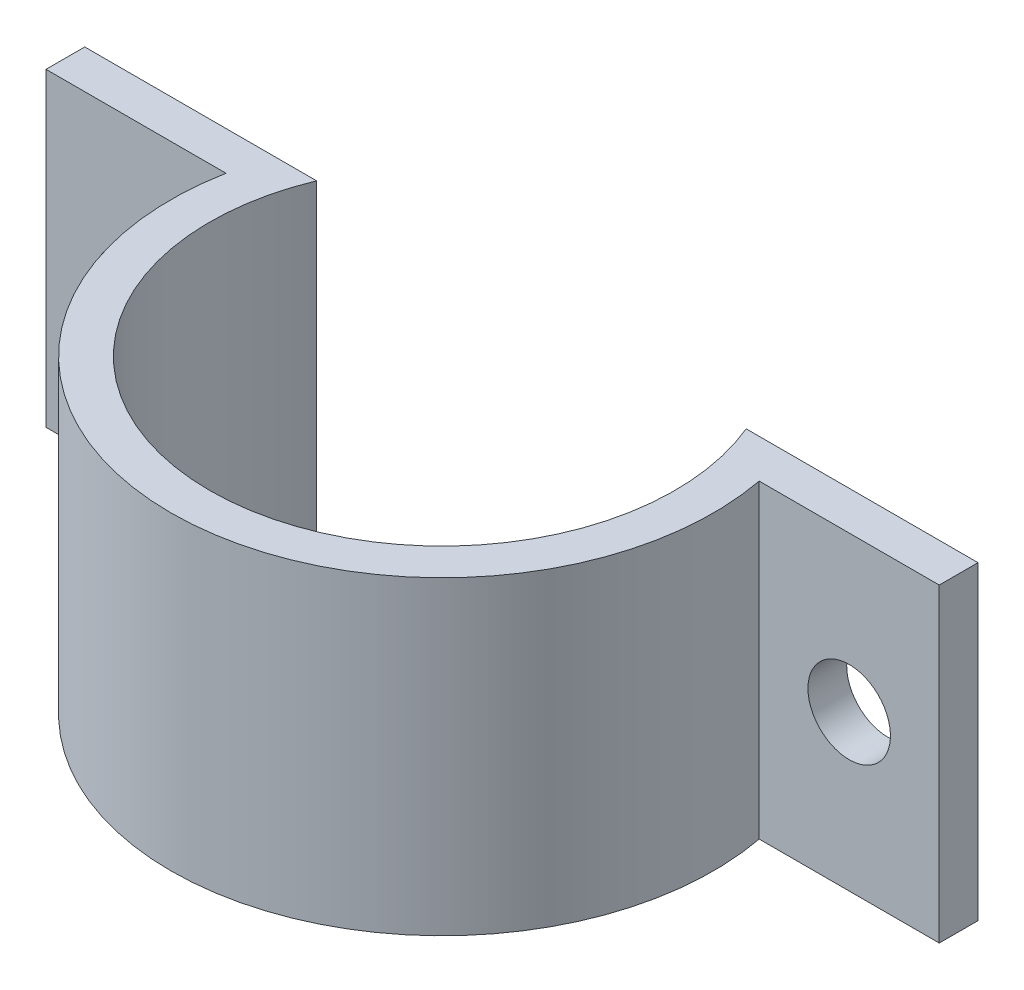
ISO-10303-21;
HEADER;
FILE_DESCRIPTION(('STEP AP214'),'2;1');
FILE_NAME('part.step','',(''),(''),'','','');
FILE_SCHEMA(('AUTOMOTIVE_DESIGN { 1 0 10303 214 1 1 1 1 }'));
ENDSEC;
DATA;
#1=APPLICATION_CONTEXT('core data for automotive mechanical design processes');
#2=APPLICATION_PROTOCOL_DEFINITION('international standard','automotive_design',2000,#1);
#3=PRODUCT_CONTEXT('',#1,'mechanical');
#4=PRODUCT('Part','Part','',(#3));
#5=PRODUCT_RELATED_PRODUCT_CATEGORY('part','',(#4));
#6=PRODUCT_DEFINITION_FORMATION('','',#4);
#7=PRODUCT_DEFINITION_CONTEXT('part definition',#1,'design');
#8=PRODUCT_DEFINITION('design','',#6,#7);
#9=PRODUCT_DEFINITION_SHAPE('','',#8);
#10=(LENGTH_UNIT() NAMED_UNIT(*) SI_UNIT(.MILLI.,.METRE.));
#11=(NAMED_UNIT(*) PLANE_ANGLE_UNIT() SI_UNIT($,.RADIAN.));
#12=(NAMED_UNIT(*) SI_UNIT($,.STERADIAN.) SOLID_ANGLE_UNIT());
#13=UNCERTAINTY_MEASURE_WITH_UNIT(LENGTH_MEASURE(1.E-05),#10,'distance_accuracy_value','');
#14=(GEOMETRIC_REPRESENTATION_CONTEXT(3) GLOBAL_UNCERTAINTY_ASSIGNED_CONTEXT((#13)) GLOBAL_UNIT_ASSIGNED_CONTEXT((#10,
#11,#12)) REPRESENTATION_CONTEXT('',''));
#15=CARTESIAN_POINT('',(0.,0.,0.));
#16=DIRECTION('',(0.,0.,1.));
#17=DIRECTION('',(1.,0.,0.));
#18=AXIS2_PLACEMENT_3D('',#15,#16,#17);
#19=CARTESIAN_POINT('',(0.,25.4,0.));
#20=DIRECTION('',(0.,1.,0.));
#21=DIRECTION('',(0.,0.,1.));
#22=AXIS2_PLACEMENT_3D('',#19,#20,#21);
#23=PLANE('',#22);
#24=DIRECTION('',(1.,0.,0.));
#25=VECTOR('',#24,1.);
#26=CARTESIAN_POINT('',(42.4748584615149,25.4,-7.3025));
#27=LINE('',#26,#25);
#28=CARTESIAN_POINT('',(-36.5873848891446,25.4,-7.30249999999999));
#29=VERTEX_POINT('',#28);
#30=CARTESIAN_POINT('',(-17.5947717731717,25.4,-7.30249999999999));
#31=VERTEX_POINT('',#30);
#32=EDGE_CURVE('E56',#29,#31,#27,.T.);
#33=ORIENTED_EDGE('',*,*,#32,.F.);
#34=DIRECTION('',(0.,0.,1.));
#35=VECTOR('',#34,1.);
#36=CARTESIAN_POINT('',(-36.5873848891447,25.4,-13.6525));
#37=LINE('',#36,#35);
#38=CARTESIAN_POINT('',(-36.5873848891447,25.4,-4.1275));
#39=VERTEX_POINT('',#38);
#40=EDGE_CURVE('E109',#29,#39,#37,.T.);
#41=ORIENTED_EDGE('',*,*,#40,.T.);
#42=DIRECTION('',(1.,0.,0.));
#43=VECTOR('',#42,1.);
#44=CARTESIAN_POINT('',(-36.5873848891447,25.4,-4.1275));
#45=LINE('',#44,#43);
#46=CARTESIAN_POINT('',(-21.8383691870524,25.4,-4.1275));
#47=VERTEX_POINT('',#46);
#48=EDGE_CURVE('E140',#39,#47,#45,.T.);
#49=ORIENTED_EDGE('',*,*,#48,.T.);
#50=CARTESIAN_POINT('',(0.,25.4,0.));
#51=DIRECTION('',(0.,1.,0.));
#52=DIRECTION('',(0.,0.,1.));
#53=AXIS2_PLACEMENT_3D('',#50,#51,#52);
#54=CIRCLE('',#53,22.225);
#55=CARTESIAN_POINT('',(21.8383691870524,25.4,-4.1275));
#56=VERTEX_POINT('',#55);
#57=EDGE_CURVE('E161',#47,#56,#54,.T.);
#58=ORIENTED_EDGE('',*,*,#57,.T.);
#59=DIRECTION('',(1.,0.,0.));
#60=VECTOR('',#59,1.);
#61=CARTESIAN_POINT('',(36.5873848891447,25.4,-4.1275));
#62=LINE('',#61,#60);
#63=CARTESIAN_POINT('',(36.5873848891447,25.4,-4.1275));
#64=VERTEX_POINT('',#63);
#65=EDGE_CURVE('E125',#56,#64,#62,.T.);
#66=ORIENTED_EDGE('',*,*,#65,.T.);
#67=DIRECTION('',(0.,0.,-1.));
#68=VECTOR('',#67,1.);
#69=CARTESIAN_POINT('',(36.5873848891447,25.4,-13.6525));
#70=LINE('',#69,#68);
#71=CARTESIAN_POINT('',(36.5873848891447,25.4,-7.3025));
#72=VERTEX_POINT('',#71);
#73=EDGE_CURVE('E120',#64,#72,#70,.T.);
#74=ORIENTED_EDGE('',*,*,#73,.T.);
#75=CARTESIAN_POINT('',(17.5947717731717,25.4,-7.30249999999999));
#76=VERTEX_POINT('',#75);
#77=EDGE_CURVE('E114',#76,#72,#27,.T.);
#78=ORIENTED_EDGE('',*,*,#77,.F.);
#79=CARTESIAN_POINT('',(0.,25.4,0.));
#80=DIRECTION('',(0.,1.,0.));
#81=DIRECTION('',(0.,0.,1.));
#82=AXIS2_PLACEMENT_3D('',#79,#80,#81);
#83=CIRCLE('',#82,19.05);
#84=EDGE_CURVE('E113',#31,#76,#83,.T.);
#85=ORIENTED_EDGE('',*,*,#84,.F.);
#86=EDGE_LOOP('',(#33,#41,#49,#58,#66,#74,#78,#85));
#87=FACE_BOUND('',#86,.T.);
#88=ADVANCED_FACE('F32',(#87),#23,.T.);
#89=CARTESIAN_POINT('',(0.,0.,0.));
#90=DIRECTION('',(0.,1.,0.));
#91=DIRECTION('',(0.,0.,1.));
#92=AXIS2_PLACEMENT_3D('',#89,#90,#91);
#93=PLANE('',#92);
#94=DIRECTION('',(0.,0.,1.));
#95=VECTOR('',#94,1.);
#96=CARTESIAN_POINT('',(-36.5873848891447,0.,-13.6525));
#97=LINE('',#96,#95);
#98=CARTESIAN_POINT('',(-36.5873848891446,0.,-7.30249999999999));
#99=VERTEX_POINT('',#98);
#100=CARTESIAN_POINT('',(-36.5873848891447,0.,-4.1275));
#101=VERTEX_POINT('',#100);
#102=EDGE_CURVE('E139',#99,#101,#97,.T.);
#103=ORIENTED_EDGE('',*,*,#102,.F.);
#104=DIRECTION('',(1.,0.,0.));
#105=VECTOR('',#104,1.);
#106=CARTESIAN_POINT('',(42.4748584615149,0.,-7.3025));
#107=LINE('',#106,#105);
#108=CARTESIAN_POINT('',(-17.5947717731717,0.,-7.30249999999999));
#109=VERTEX_POINT('',#108);
#110=EDGE_CURVE('E99',#99,#109,#107,.T.);
#111=ORIENTED_EDGE('',*,*,#110,.T.);
#112=CARTESIAN_POINT('',(0.,0.,0.));
#113=DIRECTION('',(0.,1.,0.));
#114=DIRECTION('',(0.,0.,1.));
#115=AXIS2_PLACEMENT_3D('',#112,#113,#114);
#116=CIRCLE('',#115,19.05);
#117=CARTESIAN_POINT('',(17.5947717731717,0.,-7.30249999999999));
#118=VERTEX_POINT('',#117);
#119=EDGE_CURVE('E165',#109,#118,#116,.T.);
#120=ORIENTED_EDGE('',*,*,#119,.T.);
#121=CARTESIAN_POINT('',(36.5873848891447,0.,-7.3025));
#122=VERTEX_POINT('',#121);
#123=EDGE_CURVE('E48',#118,#122,#107,.T.);
#124=ORIENTED_EDGE('',*,*,#123,.T.);
#125=DIRECTION('',(0.,0.,-1.));
#126=VECTOR('',#125,1.);
#127=CARTESIAN_POINT('',(36.5873848891447,0.,-13.6525));
#128=LINE('',#127,#126);
#129=CARTESIAN_POINT('',(36.5873848891447,0.,-4.1275));
#130=VERTEX_POINT('',#129);
#131=EDGE_CURVE('E136',#130,#122,#128,.T.);
#132=ORIENTED_EDGE('',*,*,#131,.F.);
#133=DIRECTION('',(1.,0.,0.));
#134=VECTOR('',#133,1.);
#135=CARTESIAN_POINT('',(36.5873848891447,0.,-4.1275));
#136=LINE('',#135,#134);
#137=CARTESIAN_POINT('',(21.8383691870524,0.,-4.1275));
#138=VERTEX_POINT('',#137);
#139=EDGE_CURVE('E134',#138,#130,#136,.T.);
#140=ORIENTED_EDGE('',*,*,#139,.F.);
#141=CARTESIAN_POINT('',(0.,0.,0.));
#142=DIRECTION('',(0.,1.,0.));
#143=DIRECTION('',(0.,0.,1.));
#144=AXIS2_PLACEMENT_3D('',#141,#142,#143);
#145=CIRCLE('',#144,22.225);
#146=CARTESIAN_POINT('',(-21.8383691870524,0.,-4.1275));
#147=VERTEX_POINT('',#146);
#148=EDGE_CURVE('E132',#147,#138,#145,.T.);
#149=ORIENTED_EDGE('',*,*,#148,.F.);
#150=DIRECTION('',(1.,0.,0.));
#151=VECTOR('',#150,1.);
#152=CARTESIAN_POINT('',(-36.5873848891447,0.,-4.1275));
#153=LINE('',#152,#151);
#154=EDGE_CURVE('E129',#101,#147,#153,.T.);
#155=ORIENTED_EDGE('',*,*,#154,.F.);
#156=EDGE_LOOP('',(#103,#111,#120,#124,#132,#140,#149,#155));
#157=FACE_BOUND('',#156,.T.);
#158=ADVANCED_FACE('F154',(#157),#93,.F.);
#159=CARTESIAN_POINT('',(-36.5873848891447,25.4,-4.1275));
#160=DIRECTION('',(0.,0.,-1.));
#161=DIRECTION('',(-1.,0.,0.));
#162=AXIS2_PLACEMENT_3D('',#159,#160,#161);
#163=PLANE('',#162);
#164=CARTESIAN_POINT('',(-29.21,12.7,-4.1275));
#165=DIRECTION('',(0.,0.,-1.));
#166=DIRECTION('',(-1.,0.,0.));
#167=AXIS2_PLACEMENT_3D('',#164,#165,#166);
#168=CIRCLE('',#167,3.3782);
#169=CARTESIAN_POINT('',(-32.5882,12.7,-4.1275));
#170=VERTEX_POINT('',#169);
#171=EDGE_CURVE('E171',#170,#170,#168,.T.);
#172=ORIENTED_EDGE('',*,*,#171,.T.);
#173=EDGE_LOOP('',(#172));
#174=FACE_BOUND('',#173,.T.);
#175=ORIENTED_EDGE('',*,*,#154,.T.);
#176=DIRECTION('',(0.,-1.,0.));
#177=VECTOR('',#176,1.);
#178=CARTESIAN_POINT('',(-21.8383691870524,25.4,-4.1275));
#179=LINE('',#178,#177);
#180=EDGE_CURVE('E11',#47,#147,#179,.T.);
#181=ORIENTED_EDGE('',*,*,#180,.F.);
#182=ORIENTED_EDGE('',*,*,#48,.F.);
#183=DIRECTION('',(0.,-1.,0.));
#184=VECTOR('',#183,1.);
#185=CARTESIAN_POINT('',(-36.5873848891447,25.4,-4.1275));
#186=LINE('',#185,#184);
#187=EDGE_CURVE('E118',#39,#101,#186,.T.);
#188=ORIENTED_EDGE('',*,*,#187,.T.);
#189=EDGE_LOOP('',(#175,#181,#182,#188));
#190=FACE_BOUND('',#189,.T.);
#191=ADVANCED_FACE('F34',(#174,#190),#163,.F.);
#192=CARTESIAN_POINT('',(0.,25.4,0.));
#193=DIRECTION('',(0.,-1.,0.));
#194=DIRECTION('',(0.,0.,-1.));
#195=AXIS2_PLACEMENT_3D('',#192,#193,#194);
#196=CYLINDRICAL_SURFACE('',#195,22.225);
#197=ORIENTED_EDGE('',*,*,#148,.T.);
#198=DIRECTION('',(0.,-1.,0.));
#199=VECTOR('',#198,1.);
#200=CARTESIAN_POINT('',(21.8383691870524,25.4,-4.1275));
#201=LINE('',#200,#199);
#202=EDGE_CURVE('E41',#56,#138,#201,.T.);
#203=ORIENTED_EDGE('',*,*,#202,.F.);
#204=ORIENTED_EDGE('',*,*,#57,.F.);
#205=ORIENTED_EDGE('',*,*,#180,.T.);
#206=EDGE_LOOP('',(#197,#203,#204,#205));
#207=FACE_BOUND('',#206,.T.);
#208=ADVANCED_FACE('F213',(#207),#196,.T.);
#209=CARTESIAN_POINT('',(36.5873848891447,25.4,-4.1275));
#210=DIRECTION('',(0.,0.,-1.));
#211=DIRECTION('',(-1.,0.,0.));
#212=AXIS2_PLACEMENT_3D('',#209,#210,#211);
#213=PLANE('',#212);
#214=CARTESIAN_POINT('',(29.21,12.7,-4.1275));
#215=DIRECTION('',(0.,0.,-1.));
#216=DIRECTION('',(-1.,0.,0.));
#217=AXIS2_PLACEMENT_3D('',#214,#215,#216);
#218=CIRCLE('',#217,3.3782);
#219=CARTESIAN_POINT('',(25.8318,12.7,-4.1275));
#220=VERTEX_POINT('',#219);
#221=EDGE_CURVE('E167',#220,#220,#218,.T.);
#222=ORIENTED_EDGE('',*,*,#221,.T.);
#223=EDGE_LOOP('',(#222));
#224=FACE_BOUND('',#223,.T.);
#225=ORIENTED_EDGE('',*,*,#139,.T.);
#226=DIRECTION('',(0.,-1.,0.));
#227=VECTOR('',#226,1.);
#228=CARTESIAN_POINT('',(36.5873848891447,25.4,-4.1275));
#229=LINE('',#228,#227);
#230=EDGE_CURVE('E122',#64,#130,#229,.T.);
#231=ORIENTED_EDGE('',*,*,#230,.F.);
#232=ORIENTED_EDGE('',*,*,#65,.F.);
#233=ORIENTED_EDGE('',*,*,#202,.T.);
#234=EDGE_LOOP('',(#225,#231,#232,#233));
#235=FACE_BOUND('',#234,.T.);
#236=ADVANCED_FACE('F149',(#224,#235),#213,.F.);
#237=CARTESIAN_POINT('',(36.5873848891447,25.4,-13.6525));
#238=DIRECTION('',(-1.,0.,0.));
#239=DIRECTION('',(0.,0.,1.));
#240=AXIS2_PLACEMENT_3D('',#237,#238,#239);
#241=PLANE('',#240);
#242=ORIENTED_EDGE('',*,*,#131,.T.);
#243=DIRECTION('',(0.,1.,0.));
#244=VECTOR('',#243,1.);
#245=CARTESIAN_POINT('',(36.5873848891447,25.4,-7.3025));
#246=LINE('',#245,#244);
#247=EDGE_CURVE('E103',#122,#72,#246,.T.);
#248=ORIENTED_EDGE('',*,*,#247,.T.);
#249=ORIENTED_EDGE('',*,*,#73,.F.);
#250=ORIENTED_EDGE('',*,*,#230,.T.);
#251=EDGE_LOOP('',(#242,#248,#249,#250));
#252=FACE_BOUND('',#251,.T.);
#253=ADVANCED_FACE('F159',(#252),#241,.F.);
#254=CARTESIAN_POINT('',(-36.5873848891447,25.4,-13.6525));
#255=DIRECTION('',(1.,0.,0.));
#256=DIRECTION('',(0.,0.,-1.));
#257=AXIS2_PLACEMENT_3D('',#254,#255,#256);
#258=PLANE('',#257);
#259=ORIENTED_EDGE('',*,*,#40,.F.);
#260=DIRECTION('',(0.,-1.,0.));
#261=VECTOR('',#260,1.);
#262=CARTESIAN_POINT('',(-36.5873848891447,25.4,-7.30249999999999));
#263=LINE('',#262,#261);
#264=EDGE_CURVE('E96',#29,#99,#263,.T.);
#265=ORIENTED_EDGE('',*,*,#264,.T.);
#266=ORIENTED_EDGE('',*,*,#102,.T.);
#267=ORIENTED_EDGE('',*,*,#187,.F.);
#268=EDGE_LOOP('',(#259,#265,#266,#267));
#269=FACE_BOUND('',#268,.T.);
#270=ADVANCED_FACE('F116',(#269),#258,.F.);
#271=CARTESIAN_POINT('',(0.,25.4,0.));
#272=DIRECTION('',(0.,-1.,0.));
#273=DIRECTION('',(0.,0.,-1.));
#274=AXIS2_PLACEMENT_3D('',#271,#272,#273);
#275=CYLINDRICAL_SURFACE('',#274,19.05);
#276=DIRECTION('',(0.,-1.,0.));
#277=VECTOR('',#276,1.);
#278=CARTESIAN_POINT('',(-17.5947717731717,25.4,-7.30249999999999));
#279=LINE('',#278,#277);
#280=EDGE_CURVE('E104',#31,#109,#279,.T.);
#281=ORIENTED_EDGE('',*,*,#280,.F.);
#282=ORIENTED_EDGE('',*,*,#84,.T.);
#283=DIRECTION('',(0.,-1.,0.));
#284=VECTOR('',#283,1.);
#285=CARTESIAN_POINT('',(17.5947717731717,25.4,-7.3025));
#286=LINE('',#285,#284);
#287=EDGE_CURVE('E176',#118,#76,#286,.F.);
#288=ORIENTED_EDGE('',*,*,#287,.F.);
#289=ORIENTED_EDGE('',*,*,#119,.F.);
#290=EDGE_LOOP('',(#281,#282,#288,#289));
#291=FACE_BOUND('',#290,.T.);
#292=ADVANCED_FACE('F206',(#291),#275,.F.);
#293=CARTESIAN_POINT('',(-29.21,12.7,22.225));
#294=DIRECTION('',(0.,0.,-1.));
#295=DIRECTION('',(-1.,0.,0.));
#296=AXIS2_PLACEMENT_3D('',#293,#294,#295);
#297=CYLINDRICAL_SURFACE('',#296,3.3782);
#298=CARTESIAN_POINT('',(-29.21,12.7,-7.30249999999999));
#299=DIRECTION('',(0.,0.,1.));
#300=DIRECTION('',(1.,0.,0.));
#301=AXIS2_PLACEMENT_3D('',#298,#299,#300);
#302=CIRCLE('',#301,3.3782);
#303=CARTESIAN_POINT('',(-25.8318,12.7,-7.30249999999999));
#304=VERTEX_POINT('',#303);
#305=EDGE_CURVE('E178',#304,#304,#302,.F.);
#306=ORIENTED_EDGE('',*,*,#305,.T.);
#307=EDGE_LOOP('',(#306));
#308=FACE_BOUND('',#307,.T.);
#309=ORIENTED_EDGE('',*,*,#171,.F.);
#310=EDGE_LOOP('',(#309));
#311=FACE_BOUND('',#310,.T.);
#312=ADVANCED_FACE('F196',(#308,#311),#297,.F.);
#313=CARTESIAN_POINT('',(29.21,12.7,22.225));
#314=DIRECTION('',(0.,0.,-1.));
#315=DIRECTION('',(-1.,0.,0.));
#316=AXIS2_PLACEMENT_3D('',#313,#314,#315);
#317=CYLINDRICAL_SURFACE('',#316,3.3782);
#318=CARTESIAN_POINT('',(29.21,12.7,-7.3025));
#319=DIRECTION('',(0.,0.,1.));
#320=DIRECTION('',(1.,0.,0.));
#321=AXIS2_PLACEMENT_3D('',#318,#319,#320);
#322=CIRCLE('',#321,3.3782);
#323=CARTESIAN_POINT('',(32.5882,12.7,-7.3025));
#324=VERTEX_POINT('',#323);
#325=EDGE_CURVE('E36',#324,#324,#322,.F.);
#326=ORIENTED_EDGE('',*,*,#325,.T.);
#327=EDGE_LOOP('',(#326));
#328=FACE_BOUND('',#327,.T.);
#329=ORIENTED_EDGE('',*,*,#221,.F.);
#330=EDGE_LOOP('',(#329));
#331=FACE_BOUND('',#330,.T.);
#332=ADVANCED_FACE('F185',(#328,#331),#317,.F.);
#333=CARTESIAN_POINT('',(42.4748584615149,0.,-7.3025));
#334=DIRECTION('',(0.,0.,1.));
#335=DIRECTION('',(1.,0.,0.));
#336=AXIS2_PLACEMENT_3D('',#333,#334,#335);
#337=PLANE('',#336);
#338=ORIENTED_EDGE('',*,*,#325,.F.);
#339=EDGE_LOOP('',(#338));
#340=FACE_BOUND('',#339,.T.);
#341=ORIENTED_EDGE('',*,*,#123,.F.);
#342=ORIENTED_EDGE('',*,*,#287,.T.);
#343=ORIENTED_EDGE('',*,*,#77,.T.);
#344=ORIENTED_EDGE('',*,*,#247,.F.);
#345=EDGE_LOOP('',(#341,#342,#343,#344));
#346=FACE_BOUND('',#345,.T.);
#347=ADVANCED_FACE('F188',(#340,#346),#337,.F.);
#348=ORIENTED_EDGE('',*,*,#305,.F.);
#349=EDGE_LOOP('',(#348));
#350=FACE_BOUND('',#349,.T.);
#351=ORIENTED_EDGE('',*,*,#32,.T.);
#352=ORIENTED_EDGE('',*,*,#280,.T.);
#353=ORIENTED_EDGE('',*,*,#110,.F.);
#354=ORIENTED_EDGE('',*,*,#264,.F.);
#355=EDGE_LOOP('',(#351,#352,#353,#354));
#356=FACE_BOUND('',#355,.T.);
#357=ADVANCED_FACE('F97',(#350,#356),#337,.F.);
#358=CLOSED_SHELL('',(#88,#158,#191,#208,#236,#253,#270,#292,#312,#332,#347,#357));
#359=MANIFOLD_SOLID_BREP('B2',#358);
#360=ADVANCED_BREP_SHAPE_REPRESENTATION('',(#18,#359),#14);
#361=SHAPE_DEFINITION_REPRESENTATION(#9,#360);
ENDSEC;
END-ISO-10303-21;
